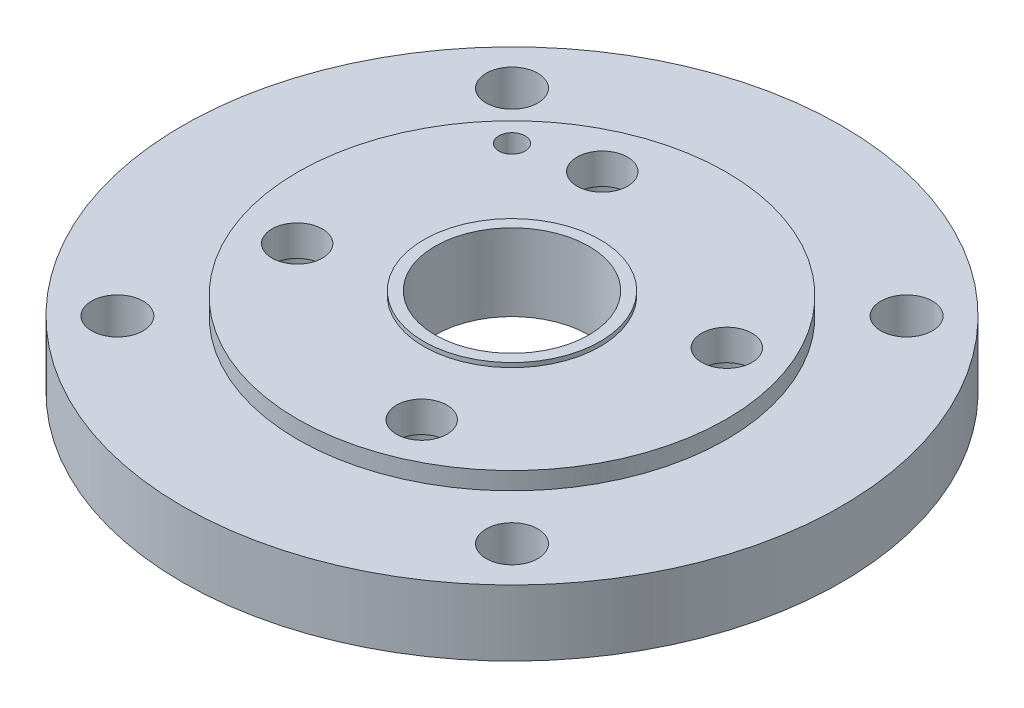
ISO-10303-21;
HEADER;
FILE_DESCRIPTION(('STEP AP214'),'2;1');
FILE_NAME('part.step','',(''),(''),'','','');
FILE_SCHEMA(('AUTOMOTIVE_DESIGN { 1 0 10303 214 1 1 1 1 }'));
ENDSEC;
DATA;
#1=APPLICATION_CONTEXT('core data for automotive mechanical design processes');
#2=APPLICATION_PROTOCOL_DEFINITION('international standard','automotive_design',2000,#1);
#3=PRODUCT_CONTEXT('',#1,'mechanical');
#4=PRODUCT('Part','Part','',(#3));
#5=PRODUCT_RELATED_PRODUCT_CATEGORY('part','',(#4));
#6=PRODUCT_DEFINITION_FORMATION('','',#4);
#7=PRODUCT_DEFINITION_CONTEXT('part definition',#1,'design');
#8=PRODUCT_DEFINITION('design','',#6,#7);
#9=PRODUCT_DEFINITION_SHAPE('','',#8);
#10=(LENGTH_UNIT() NAMED_UNIT(*) SI_UNIT(.MILLI.,.METRE.));
#11=(NAMED_UNIT(*) PLANE_ANGLE_UNIT() SI_UNIT($,.RADIAN.));
#12=(NAMED_UNIT(*) SI_UNIT($,.STERADIAN.) SOLID_ANGLE_UNIT());
#13=UNCERTAINTY_MEASURE_WITH_UNIT(LENGTH_MEASURE(1.E-05),#10,'distance_accuracy_value','');
#14=(GEOMETRIC_REPRESENTATION_CONTEXT(3) GLOBAL_UNCERTAINTY_ASSIGNED_CONTEXT((#13)) GLOBAL_UNIT_ASSIGNED_CONTEXT((#10,
#11,#12)) REPRESENTATION_CONTEXT('',''));
#15=CARTESIAN_POINT('',(0.,0.,0.));
#16=DIRECTION('',(0.,0.,1.));
#17=DIRECTION('',(1.,0.,0.));
#18=AXIS2_PLACEMENT_3D('',#15,#16,#17);
#19=CARTESIAN_POINT('',(0.,40.,0.));
#20=DIRECTION('',(0.,-1.,0.));
#21=DIRECTION('',(0.,0.,-1.));
#22=AXIS2_PLACEMENT_3D('',#19,#20,#21);
#23=CYLINDRICAL_SURFACE('',#22,35.);
#24=CARTESIAN_POINT('',(0.,40.,0.));
#25=DIRECTION('',(0.,1.,0.));
#26=DIRECTION('',(0.,0.,1.));
#27=AXIS2_PLACEMENT_3D('',#24,#25,#26);
#28=CIRCLE('',#27,35.);
#29=CARTESIAN_POINT('',(0.,40.,35.));
#30=VERTEX_POINT('',#29);
#31=EDGE_CURVE('E145',#30,#30,#28,.T.);
#32=ORIENTED_EDGE('',*,*,#31,.T.);
#33=EDGE_LOOP('',(#32));
#34=FACE_BOUND('',#33,.T.);
#35=CARTESIAN_POINT('',(0.,5.,0.));
#36=DIRECTION('',(0.,-1.,0.));
#37=DIRECTION('',(0.,0.,-1.));
#38=AXIS2_PLACEMENT_3D('',#35,#36,#37);
#39=CIRCLE('',#38,35.);
#40=CARTESIAN_POINT('',(0.,5.,-35.));
#41=VERTEX_POINT('',#40);
#42=EDGE_CURVE('E98',#41,#41,#39,.T.);
#43=ORIENTED_EDGE('',*,*,#42,.T.);
#44=EDGE_LOOP('',(#43));
#45=FACE_BOUND('',#44,.T.);
#46=ADVANCED_FACE('F65',(#34,#45),#23,.F.);
#47=CARTESIAN_POINT('',(-69.4402938607498,38.,28.3380590113846));
#48=DIRECTION('',(0.,-1.,0.));
#49=DIRECTION('',(0.,0.,-1.));
#50=AXIS2_PLACEMENT_3D('',#47,#48,#49);
#51=CYLINDRICAL_SURFACE('',#50,17.5);
#52=CARTESIAN_POINT('',(-69.4402938607498,0.,28.3380590113846));
#53=DIRECTION('',(0.,1.,0.));
#54=DIRECTION('',(0.,0.,1.));
#55=AXIS2_PLACEMENT_3D('',#52,#53,#54);
#56=CIRCLE('',#55,17.5);
#57=CARTESIAN_POINT('',(-69.4402938607498,0.,45.8380590113846));
#58=VERTEX_POINT('',#57);
#59=EDGE_CURVE('E163',#58,#58,#56,.T.);
#60=ORIENTED_EDGE('',*,*,#59,.F.);
#61=EDGE_LOOP('',(#60));
#62=FACE_BOUND('',#61,.T.);
#63=CARTESIAN_POINT('',(-69.4402938607498,24.,28.3380590113846));
#64=DIRECTION('',(0.,1.,0.));
#65=DIRECTION('',(0.,0.,1.));
#66=AXIS2_PLACEMENT_3D('',#63,#64,#65);
#67=CIRCLE('',#66,17.5);
#68=CARTESIAN_POINT('',(-69.4402938607498,24.,45.8380590113846));
#69=VERTEX_POINT('',#68);
#70=EDGE_CURVE('E113',#69,#69,#67,.T.);
#71=ORIENTED_EDGE('',*,*,#70,.T.);
#72=EDGE_LOOP('',(#71));
#73=FACE_BOUND('',#72,.T.);
#74=ADVANCED_FACE('F232',(#62,#73),#51,.F.);
#75=CARTESIAN_POINT('',(28.3380590113846,38.,69.4402938607498));
#76=DIRECTION('',(0.,-1.,0.));
#77=DIRECTION('',(0.,0.,-1.));
#78=AXIS2_PLACEMENT_3D('',#75,#76,#77);
#79=CYLINDRICAL_SURFACE('',#78,17.5);
#80=CARTESIAN_POINT('',(28.3380590113846,0.,69.4402938607498));
#81=DIRECTION('',(0.,1.,0.));
#82=DIRECTION('',(0.,0.,1.));
#83=AXIS2_PLACEMENT_3D('',#80,#81,#82);
#84=CIRCLE('',#83,17.5);
#85=CARTESIAN_POINT('',(28.3380590113846,0.,86.9402938607498));
#86=VERTEX_POINT('',#85);
#87=EDGE_CURVE('E166',#86,#86,#84,.T.);
#88=ORIENTED_EDGE('',*,*,#87,.F.);
#89=EDGE_LOOP('',(#88));
#90=FACE_BOUND('',#89,.T.);
#91=CARTESIAN_POINT('',(28.3380590113846,24.,69.4402938607498));
#92=DIRECTION('',(0.,1.,0.));
#93=DIRECTION('',(0.,0.,1.));
#94=AXIS2_PLACEMENT_3D('',#91,#92,#93);
#95=CIRCLE('',#94,17.5);
#96=CARTESIAN_POINT('',(28.3380590113846,24.,86.9402938607498));
#97=VERTEX_POINT('',#96);
#98=EDGE_CURVE('E122',#97,#97,#95,.T.);
#99=ORIENTED_EDGE('',*,*,#98,.T.);
#100=EDGE_LOOP('',(#99));
#101=FACE_BOUND('',#100,.T.);
#102=ADVANCED_FACE('F239',(#90,#101),#79,.F.);
#103=CARTESIAN_POINT('',(69.4402938607498,38.,-28.3380590113846));
#104=DIRECTION('',(0.,-1.,0.));
#105=DIRECTION('',(0.,0.,-1.));
#106=AXIS2_PLACEMENT_3D('',#103,#104,#105);
#107=CYLINDRICAL_SURFACE('',#106,17.5);
#108=CARTESIAN_POINT('',(69.4402938607498,0.,-28.3380590113846));
#109=DIRECTION('',(0.,1.,0.));
#110=DIRECTION('',(0.,0.,1.));
#111=AXIS2_PLACEMENT_3D('',#108,#109,#110);
#112=CIRCLE('',#111,17.5);
#113=CARTESIAN_POINT('',(69.4402938607498,0.,-10.8380590113846));
#114=VERTEX_POINT('',#113);
#115=EDGE_CURVE('E169',#114,#114,#112,.T.);
#116=ORIENTED_EDGE('',*,*,#115,.F.);
#117=EDGE_LOOP('',(#116));
#118=FACE_BOUND('',#117,.T.);
#119=CARTESIAN_POINT('',(69.4402938607498,24.,-28.3380590113846));
#120=DIRECTION('',(0.,1.,0.));
#121=DIRECTION('',(0.,0.,1.));
#122=AXIS2_PLACEMENT_3D('',#119,#120,#121);
#123=CIRCLE('',#122,17.5);
#124=CARTESIAN_POINT('',(69.4402938607498,24.,-10.8380590113846));
#125=VERTEX_POINT('',#124);
#126=EDGE_CURVE('E131',#125,#125,#123,.T.);
#127=ORIENTED_EDGE('',*,*,#126,.T.);
#128=EDGE_LOOP('',(#127));
#129=FACE_BOUND('',#128,.T.);
#130=ADVANCED_FACE('F331',(#118,#129),#107,.F.);
#131=CARTESIAN_POINT('',(-28.3380590113846,38.,-69.4402938607498));
#132=DIRECTION('',(0.,-1.,0.));
#133=DIRECTION('',(0.,0.,-1.));
#134=AXIS2_PLACEMENT_3D('',#131,#132,#133);
#135=CYLINDRICAL_SURFACE('',#134,17.5);
#136=CARTESIAN_POINT('',(-28.3380590113846,0.,-69.4402938607498));
#137=DIRECTION('',(0.,1.,0.));
#138=DIRECTION('',(0.,0.,1.));
#139=AXIS2_PLACEMENT_3D('',#136,#137,#138);
#140=CIRCLE('',#139,17.5);
#141=CARTESIAN_POINT('',(-28.3380590113846,0.,-51.9402938607498));
#142=VERTEX_POINT('',#141);
#143=EDGE_CURVE('E151',#142,#142,#140,.T.);
#144=ORIENTED_EDGE('',*,*,#143,.F.);
#145=EDGE_LOOP('',(#144));
#146=FACE_BOUND('',#145,.T.);
#147=CARTESIAN_POINT('',(-28.3380590113846,24.,-69.4402938607498));
#148=DIRECTION('',(0.,1.,0.));
#149=DIRECTION('',(0.,0.,1.));
#150=AXIS2_PLACEMENT_3D('',#147,#148,#149);
#151=CIRCLE('',#150,17.5);
#152=CARTESIAN_POINT('',(-28.3380590113846,24.,-51.9402938607498));
#153=VERTEX_POINT('',#152);
#154=EDGE_CURVE('E140',#153,#153,#151,.T.);
#155=ORIENTED_EDGE('',*,*,#154,.T.);
#156=EDGE_LOOP('',(#155));
#157=FACE_BOUND('',#156,.T.);
#158=ADVANCED_FACE('F199',(#146,#157),#135,.F.);
#159=CARTESIAN_POINT('',(-89.8025612106916,30.,-89.8025612106915));
#160=DIRECTION('',(0.,-1.,0.));
#161=DIRECTION('',(0.,0.,-1.));
#162=AXIS2_PLACEMENT_3D('',#159,#160,#161);
#163=CYLINDRICAL_SURFACE('',#162,11.75);
#164=CARTESIAN_POINT('',(-89.8025612106916,30.,-89.8025612106915));
#165=DIRECTION('',(0.,1.,0.));
#166=DIRECTION('',(0.,0.,1.));
#167=AXIS2_PLACEMENT_3D('',#164,#165,#166);
#168=CIRCLE('',#167,11.75);
#169=CARTESIAN_POINT('',(-89.8025612106916,30.,-78.0525612106915));
#170=VERTEX_POINT('',#169);
#171=EDGE_CURVE('E73',#170,#170,#168,.T.);
#172=ORIENTED_EDGE('',*,*,#171,.T.);
#173=EDGE_LOOP('',(#172));
#174=FACE_BOUND('',#173,.T.);
#175=CARTESIAN_POINT('',(-89.8025612106916,0.,-89.8025612106915));
#176=DIRECTION('',(0.,1.,0.));
#177=DIRECTION('',(0.,0.,1.));
#178=AXIS2_PLACEMENT_3D('',#175,#176,#177);
#179=CIRCLE('',#178,11.75);
#180=CARTESIAN_POINT('',(-89.8025612106916,0.,-78.0525612106915));
#181=VERTEX_POINT('',#180);
#182=EDGE_CURVE('E92',#181,#181,#179,.T.);
#183=ORIENTED_EDGE('',*,*,#182,.F.);
#184=EDGE_LOOP('',(#183));
#185=FACE_BOUND('',#184,.T.);
#186=ADVANCED_FACE('F196',(#174,#185),#163,.F.);
#187=CARTESIAN_POINT('',(89.8025612106915,30.,-89.8025612106916));
#188=DIRECTION('',(0.,-1.,0.));
#189=DIRECTION('',(0.,0.,-1.));
#190=AXIS2_PLACEMENT_3D('',#187,#188,#189);
#191=CYLINDRICAL_SURFACE('',#190,11.75);
#192=CARTESIAN_POINT('',(89.8025612106915,30.,-89.8025612106916));
#193=DIRECTION('',(0.,1.,0.));
#194=DIRECTION('',(0.,0.,1.));
#195=AXIS2_PLACEMENT_3D('',#192,#193,#194);
#196=CIRCLE('',#195,11.75);
#197=CARTESIAN_POINT('',(89.8025612106915,30.,-78.0525612106916));
#198=VERTEX_POINT('',#197);
#199=EDGE_CURVE('E78',#198,#198,#196,.T.);
#200=ORIENTED_EDGE('',*,*,#199,.T.);
#201=EDGE_LOOP('',(#200));
#202=FACE_BOUND('',#201,.T.);
#203=CARTESIAN_POINT('',(89.8025612106915,0.,-89.8025612106916));
#204=DIRECTION('',(0.,1.,0.));
#205=DIRECTION('',(0.,0.,1.));
#206=AXIS2_PLACEMENT_3D('',#203,#204,#205);
#207=CIRCLE('',#206,11.75);
#208=CARTESIAN_POINT('',(89.8025612106915,0.,-78.0525612106916));
#209=VERTEX_POINT('',#208);
#210=EDGE_CURVE('E89',#209,#209,#207,.T.);
#211=ORIENTED_EDGE('',*,*,#210,.F.);
#212=EDGE_LOOP('',(#211));
#213=FACE_BOUND('',#212,.T.);
#214=ADVANCED_FACE('F184',(#202,#213),#191,.F.);
#215=CARTESIAN_POINT('',(89.8025612106916,30.,89.8025612106915));
#216=DIRECTION('',(0.,-1.,0.));
#217=DIRECTION('',(0.,0.,-1.));
#218=AXIS2_PLACEMENT_3D('',#215,#216,#217);
#219=CYLINDRICAL_SURFACE('',#218,11.75);
#220=CARTESIAN_POINT('',(89.8025612106916,30.,89.8025612106915));
#221=DIRECTION('',(0.,1.,0.));
#222=DIRECTION('',(0.,0.,1.));
#223=AXIS2_PLACEMENT_3D('',#220,#221,#222);
#224=CIRCLE('',#223,11.75);
#225=CARTESIAN_POINT('',(89.8025612106916,30.,101.552561210692));
#226=VERTEX_POINT('',#225);
#227=EDGE_CURVE('E179',#226,#226,#224,.T.);
#228=ORIENTED_EDGE('',*,*,#227,.T.);
#229=EDGE_LOOP('',(#228));
#230=FACE_BOUND('',#229,.T.);
#231=CARTESIAN_POINT('',(89.8025612106916,0.,89.8025612106915));
#232=DIRECTION('',(0.,1.,0.));
#233=DIRECTION('',(0.,0.,1.));
#234=AXIS2_PLACEMENT_3D('',#231,#232,#233);
#235=CIRCLE('',#234,11.75);
#236=CARTESIAN_POINT('',(89.8025612106916,0.,101.552561210692));
#237=VERTEX_POINT('',#236);
#238=EDGE_CURVE('E85',#237,#237,#235,.T.);
#239=ORIENTED_EDGE('',*,*,#238,.F.);
#240=EDGE_LOOP('',(#239));
#241=FACE_BOUND('',#240,.T.);
#242=ADVANCED_FACE('F393',(#230,#241),#219,.F.);
#243=CARTESIAN_POINT('',(-89.8025612106915,30.,89.8025612106916));
#244=DIRECTION('',(0.,-1.,0.));
#245=DIRECTION('',(0.,0.,-1.));
#246=AXIS2_PLACEMENT_3D('',#243,#244,#245);
#247=CYLINDRICAL_SURFACE('',#246,11.75);
#248=CARTESIAN_POINT('',(-89.8025612106915,30.,89.8025612106916));
#249=DIRECTION('',(0.,1.,0.));
#250=DIRECTION('',(0.,0.,1.));
#251=AXIS2_PLACEMENT_3D('',#248,#249,#250);
#252=CIRCLE('',#251,11.75);
#253=CARTESIAN_POINT('',(-89.8025612106915,30.,101.552561210692));
#254=VERTEX_POINT('',#253);
#255=EDGE_CURVE('E176',#254,#254,#252,.T.);
#256=ORIENTED_EDGE('',*,*,#255,.T.);
#257=EDGE_LOOP('',(#256));
#258=FACE_BOUND('',#257,.T.);
#259=CARTESIAN_POINT('',(-89.8025612106915,0.,89.8025612106916));
#260=DIRECTION('',(0.,1.,0.));
#261=DIRECTION('',(0.,0.,1.));
#262=AXIS2_PLACEMENT_3D('',#259,#260,#261);
#263=CIRCLE('',#262,11.75);
#264=CARTESIAN_POINT('',(-89.8025612106915,0.,101.552561210692));
#265=VERTEX_POINT('',#264);
#266=EDGE_CURVE('E82',#265,#265,#263,.T.);
#267=ORIENTED_EDGE('',*,*,#266,.F.);
#268=EDGE_LOOP('',(#267));
#269=FACE_BOUND('',#268,.T.);
#270=ADVANCED_FACE('F67',(#258,#269),#247,.F.);
#271=CARTESIAN_POINT('',(0.,30.,0.));
#272=DIRECTION('',(0.,-1.,0.));
#273=DIRECTION('',(0.,0.,-1.));
#274=AXIS2_PLACEMENT_3D('',#271,#272,#273);
#275=CYLINDRICAL_SURFACE('',#274,150.);
#276=CARTESIAN_POINT('',(0.,30.,0.));
#277=DIRECTION('',(0.,1.,0.));
#278=DIRECTION('',(0.,0.,1.));
#279=AXIS2_PLACEMENT_3D('',#276,#277,#278);
#280=CIRCLE('',#279,150.);
#281=CARTESIAN_POINT('',(0.,30.,150.));
#282=VERTEX_POINT('',#281);
#283=EDGE_CURVE('E11',#282,#282,#280,.T.);
#284=ORIENTED_EDGE('',*,*,#283,.F.);
#285=EDGE_LOOP('',(#284));
#286=FACE_BOUND('',#285,.T.);
#287=CARTESIAN_POINT('',(0.,0.,0.));
#288=DIRECTION('',(0.,1.,0.));
#289=DIRECTION('',(0.,0.,1.));
#290=AXIS2_PLACEMENT_3D('',#287,#288,#289);
#291=CIRCLE('',#290,150.);
#292=CARTESIAN_POINT('',(0.,0.,150.));
#293=VERTEX_POINT('',#292);
#294=EDGE_CURVE('E95',#293,#293,#291,.T.);
#295=ORIENTED_EDGE('',*,*,#294,.T.);
#296=EDGE_LOOP('',(#295));
#297=FACE_BOUND('',#296,.T.);
#298=ADVANCED_FACE('F191',(#286,#297),#275,.T.);
#299=CARTESIAN_POINT('',(0.,30.,0.));
#300=DIRECTION('',(0.,1.,0.));
#301=DIRECTION('',(0.,0.,1.));
#302=AXIS2_PLACEMENT_3D('',#299,#300,#301);
#303=PLANE('',#302);
#304=CARTESIAN_POINT('',(0.,30.,0.));
#305=DIRECTION('',(0.,1.,0.));
#306=DIRECTION('',(0.,0.,1.));
#307=AXIS2_PLACEMENT_3D('',#304,#305,#306);
#308=CIRCLE('',#307,97.5);
#309=CARTESIAN_POINT('',(0.,30.,97.5));
#310=VERTEX_POINT('',#309);
#311=EDGE_CURVE('E97',#310,#310,#308,.T.);
#312=ORIENTED_EDGE('',*,*,#311,.F.);
#313=EDGE_LOOP('',(#312));
#314=FACE_BOUND('',#313,.T.);
#315=ORIENTED_EDGE('',*,*,#255,.F.);
#316=EDGE_LOOP('',(#315));
#317=FACE_BOUND('',#316,.T.);
#318=ORIENTED_EDGE('',*,*,#227,.F.);
#319=EDGE_LOOP('',(#318));
#320=FACE_BOUND('',#319,.T.);
#321=ORIENTED_EDGE('',*,*,#199,.F.);
#322=EDGE_LOOP('',(#321));
#323=FACE_BOUND('',#322,.T.);
#324=ORIENTED_EDGE('',*,*,#171,.F.);
#325=EDGE_LOOP('',(#324));
#326=FACE_BOUND('',#325,.T.);
#327=ORIENTED_EDGE('',*,*,#283,.T.);
#328=EDGE_LOOP('',(#327));
#329=FACE_BOUND('',#328,.T.);
#330=ADVANCED_FACE('F187',(#314,#317,#320,#323,#326,#329),#303,.T.);
#331=CARTESIAN_POINT('',(0.,0.,0.));
#332=DIRECTION('',(0.,1.,0.));
#333=DIRECTION('',(0.,0.,1.));
#334=AXIS2_PLACEMENT_3D('',#331,#332,#333);
#335=PLANE('',#334);
#336=CARTESIAN_POINT('',(0.,0.,0.));
#337=DIRECTION('',(0.,1.,0.));
#338=DIRECTION('',(0.,0.,1.));
#339=AXIS2_PLACEMENT_3D('',#336,#337,#338);
#340=CIRCLE('',#339,43.5);
#341=CARTESIAN_POINT('',(0.,0.,43.5));
#342=VERTEX_POINT('',#341);
#343=EDGE_CURVE('E69',#342,#342,#340,.F.);
#344=ORIENTED_EDGE('',*,*,#343,.F.);
#345=EDGE_LOOP('',(#344));
#346=FACE_BOUND('',#345,.T.);
#347=ORIENTED_EDGE('',*,*,#266,.T.);
#348=EDGE_LOOP('',(#347));
#349=FACE_BOUND('',#348,.T.);
#350=ORIENTED_EDGE('',*,*,#238,.T.);
#351=EDGE_LOOP('',(#350));
#352=FACE_BOUND('',#351,.T.);
#353=ORIENTED_EDGE('',*,*,#210,.T.);
#354=EDGE_LOOP('',(#353));
#355=FACE_BOUND('',#354,.T.);
#356=ORIENTED_EDGE('',*,*,#182,.T.);
#357=EDGE_LOOP('',(#356));
#358=FACE_BOUND('',#357,.T.);
#359=ORIENTED_EDGE('',*,*,#294,.F.);
#360=EDGE_LOOP('',(#359));
#361=FACE_BOUND('',#360,.T.);
#362=ORIENTED_EDGE('',*,*,#143,.T.);
#363=EDGE_LOOP('',(#362));
#364=FACE_BOUND('',#363,.T.);
#365=ORIENTED_EDGE('',*,*,#59,.T.);
#366=EDGE_LOOP('',(#365));
#367=FACE_BOUND('',#366,.T.);
#368=ORIENTED_EDGE('',*,*,#87,.T.);
#369=EDGE_LOOP('',(#368));
#370=FACE_BOUND('',#369,.T.);
#371=ORIENTED_EDGE('',*,*,#115,.T.);
#372=EDGE_LOOP('',(#371));
#373=FACE_BOUND('',#372,.T.);
#374=CARTESIAN_POINT('',(-60.,0.,-60.));
#375=DIRECTION('',(0.,1.,0.));
#376=DIRECTION('',(0.,0.,1.));
#377=AXIS2_PLACEMENT_3D('',#374,#375,#376);
#378=CIRCLE('',#377,6.00000000000001);
#379=CARTESIAN_POINT('',(-60.,0.,-54.));
#380=VERTEX_POINT('',#379);
#381=EDGE_CURVE('E156',#380,#380,#378,.T.);
#382=ORIENTED_EDGE('',*,*,#381,.T.);
#383=EDGE_LOOP('',(#382));
#384=FACE_BOUND('',#383,.T.);
#385=ADVANCED_FACE('F190',(#346,#349,#352,#355,#358,#361,#364,#367,#370,#373,#384),#335,.F.);
#386=CARTESIAN_POINT('',(-60.,38.,-60.));
#387=DIRECTION('',(0.,-1.,0.));
#388=DIRECTION('',(0.,0.,-1.));
#389=AXIS2_PLACEMENT_3D('',#386,#387,#388);
#390=CYLINDRICAL_SURFACE('',#389,6.00000000000001);
#391=CARTESIAN_POINT('',(-60.,38.,-60.));
#392=DIRECTION('',(0.,1.,0.));
#393=DIRECTION('',(0.,0.,1.));
#394=AXIS2_PLACEMENT_3D('',#391,#392,#393);
#395=CIRCLE('',#394,6.00000000000001);
#396=CARTESIAN_POINT('',(-60.,38.,-54.));
#397=VERTEX_POINT('',#396);
#398=EDGE_CURVE('E155',#397,#397,#395,.T.);
#399=ORIENTED_EDGE('',*,*,#398,.T.);
#400=EDGE_LOOP('',(#399));
#401=FACE_BOUND('',#400,.T.);
#402=ORIENTED_EDGE('',*,*,#381,.F.);
#403=EDGE_LOOP('',(#402));
#404=FACE_BOUND('',#403,.T.);
#405=ADVANCED_FACE('F205',(#401,#404),#390,.F.);
#406=CARTESIAN_POINT('',(0.,38.,0.));
#407=DIRECTION('',(0.,-1.,0.));
#408=DIRECTION('',(0.,0.,-1.));
#409=AXIS2_PLACEMENT_3D('',#406,#407,#408);
#410=CYLINDRICAL_SURFACE('',#409,97.5);
#411=ORIENTED_EDGE('',*,*,#311,.T.);
#412=EDGE_LOOP('',(#411));
#413=FACE_BOUND('',#412,.T.);
#414=CARTESIAN_POINT('',(0.,38.,0.));
#415=DIRECTION('',(0.,1.,0.));
#416=DIRECTION('',(0.,0.,1.));
#417=AXIS2_PLACEMENT_3D('',#414,#415,#416);
#418=CIRCLE('',#417,97.5);
#419=CARTESIAN_POINT('',(0.,38.,97.5));
#420=VERTEX_POINT('',#419);
#421=EDGE_CURVE('E86',#420,#420,#418,.T.);
#422=ORIENTED_EDGE('',*,*,#421,.F.);
#423=EDGE_LOOP('',(#422));
#424=FACE_BOUND('',#423,.T.);
#425=ADVANCED_FACE('F221',(#413,#424),#410,.T.);
#426=CARTESIAN_POINT('',(0.,38.,0.));
#427=DIRECTION('',(0.,1.,0.));
#428=DIRECTION('',(0.,0.,1.));
#429=AXIS2_PLACEMENT_3D('',#426,#427,#428);
#430=PLANE('',#429);
#431=CARTESIAN_POINT('',(0.,38.,0.));
#432=DIRECTION('',(0.,1.,0.));
#433=DIRECTION('',(0.,0.,1.));
#434=AXIS2_PLACEMENT_3D('',#431,#432,#433);
#435=CIRCLE('',#434,40.15);
#436=CARTESIAN_POINT('',(0.,38.,40.15));
#437=VERTEX_POINT('',#436);
#438=EDGE_CURVE('E152',#437,#437,#435,.T.);
#439=ORIENTED_EDGE('',*,*,#438,.F.);
#440=EDGE_LOOP('',(#439));
#441=FACE_BOUND('',#440,.T.);
#442=ORIENTED_EDGE('',*,*,#398,.F.);
#443=EDGE_LOOP('',(#442));
#444=FACE_BOUND('',#443,.T.);
#445=ORIENTED_EDGE('',*,*,#421,.T.);
#446=EDGE_LOOP('',(#445));
#447=FACE_BOUND('',#446,.T.);
#448=CARTESIAN_POINT('',(-28.3380590113846,38.,-69.4402938607498));
#449=DIRECTION('',(0.,1.,0.));
#450=DIRECTION('',(0.,0.,1.));
#451=AXIS2_PLACEMENT_3D('',#448,#449,#450);
#452=CIRCLE('',#451,11.5);
#453=CARTESIAN_POINT('',(-28.3380590113846,38.,-57.9402938607498));
#454=VERTEX_POINT('',#453);
#455=EDGE_CURVE('E136',#454,#454,#452,.T.);
#456=ORIENTED_EDGE('',*,*,#455,.F.);
#457=EDGE_LOOP('',(#456));
#458=FACE_BOUND('',#457,.T.);
#459=CARTESIAN_POINT('',(69.4402938607498,38.,-28.3380590113846));
#460=DIRECTION('',(0.,1.,0.));
#461=DIRECTION('',(0.,0.,1.));
#462=AXIS2_PLACEMENT_3D('',#459,#460,#461);
#463=CIRCLE('',#462,11.5);
#464=CARTESIAN_POINT('',(69.4402938607498,38.,-16.8380590113846));
#465=VERTEX_POINT('',#464);
#466=EDGE_CURVE('E127',#465,#465,#463,.T.);
#467=ORIENTED_EDGE('',*,*,#466,.F.);
#468=EDGE_LOOP('',(#467));
#469=FACE_BOUND('',#468,.T.);
#470=CARTESIAN_POINT('',(28.3380590113846,38.,69.4402938607498));
#471=DIRECTION('',(0.,1.,0.));
#472=DIRECTION('',(0.,0.,1.));
#473=AXIS2_PLACEMENT_3D('',#470,#471,#472);
#474=CIRCLE('',#473,11.5);
#475=CARTESIAN_POINT('',(28.3380590113846,38.,80.9402938607498));
#476=VERTEX_POINT('',#475);
#477=EDGE_CURVE('E118',#476,#476,#474,.T.);
#478=ORIENTED_EDGE('',*,*,#477,.F.);
#479=EDGE_LOOP('',(#478));
#480=FACE_BOUND('',#479,.T.);
#481=CARTESIAN_POINT('',(-69.4402938607498,38.,28.3380590113846));
#482=DIRECTION('',(0.,1.,0.));
#483=DIRECTION('',(0.,0.,1.));
#484=AXIS2_PLACEMENT_3D('',#481,#482,#483);
#485=CIRCLE('',#484,11.5);
#486=CARTESIAN_POINT('',(-69.4402938607498,38.,39.8380590113846));
#487=VERTEX_POINT('',#486);
#488=EDGE_CURVE('E104',#487,#487,#485,.T.);
#489=ORIENTED_EDGE('',*,*,#488,.F.);
#490=EDGE_LOOP('',(#489));
#491=FACE_BOUND('',#490,.T.);
#492=ADVANCED_FACE('F227',(#441,#444,#447,#458,#469,#480,#491),#430,.T.);
#493=CARTESIAN_POINT('',(0.,40.,0.));
#494=DIRECTION('',(0.,-1.,0.));
#495=DIRECTION('',(0.,0.,-1.));
#496=AXIS2_PLACEMENT_3D('',#493,#494,#495);
#497=CYLINDRICAL_SURFACE('',#496,40.15);
#498=ORIENTED_EDGE('',*,*,#438,.T.);
#499=EDGE_LOOP('',(#498));
#500=FACE_BOUND('',#499,.T.);
#501=CARTESIAN_POINT('',(0.,40.,0.));
#502=DIRECTION('',(0.,1.,0.));
#503=DIRECTION('',(0.,0.,1.));
#504=AXIS2_PLACEMENT_3D('',#501,#502,#503);
#505=CIRCLE('',#504,40.15);
#506=CARTESIAN_POINT('',(0.,40.,40.15));
#507=VERTEX_POINT('',#506);
#508=EDGE_CURVE('E148',#507,#507,#505,.T.);
#509=ORIENTED_EDGE('',*,*,#508,.F.);
#510=EDGE_LOOP('',(#509));
#511=FACE_BOUND('',#510,.T.);
#512=ADVANCED_FACE('F244',(#500,#511),#497,.T.);
#513=CARTESIAN_POINT('',(0.,40.,0.));
#514=DIRECTION('',(0.,1.,0.));
#515=DIRECTION('',(0.,0.,1.));
#516=AXIS2_PLACEMENT_3D('',#513,#514,#515);
#517=PLANE('',#516);
#518=ORIENTED_EDGE('',*,*,#31,.F.);
#519=EDGE_LOOP('',(#518));
#520=FACE_BOUND('',#519,.T.);
#521=ORIENTED_EDGE('',*,*,#508,.T.);
#522=EDGE_LOOP('',(#521));
#523=FACE_BOUND('',#522,.T.);
#524=ADVANCED_FACE('F253',(#520,#523),#517,.T.);
#525=CARTESIAN_POINT('',(-28.3380590113846,24.,-69.4402938607498));
#526=DIRECTION('',(0.,1.,0.));
#527=DIRECTION('',(0.,0.,1.));
#528=AXIS2_PLACEMENT_3D('',#525,#526,#527);
#529=PLANE('',#528);
#530=CARTESIAN_POINT('',(-28.3380590113846,24.,-69.4402938607498));
#531=DIRECTION('',(0.,1.,0.));
#532=DIRECTION('',(0.,0.,1.));
#533=AXIS2_PLACEMENT_3D('',#530,#531,#532);
#534=CIRCLE('',#533,11.5);
#535=CARTESIAN_POINT('',(-28.3380590113846,24.,-57.9402938607498));
#536=VERTEX_POINT('',#535);
#537=EDGE_CURVE('E137',#536,#536,#534,.T.);
#538=ORIENTED_EDGE('',*,*,#537,.T.);
#539=EDGE_LOOP('',(#538));
#540=FACE_BOUND('',#539,.T.);
#541=ORIENTED_EDGE('',*,*,#154,.F.);
#542=EDGE_LOOP('',(#541));
#543=FACE_BOUND('',#542,.T.);
#544=ADVANCED_FACE('F305',(#540,#543),#529,.F.);
#545=CARTESIAN_POINT('',(-28.3380590113846,24.,-69.4402938607498));
#546=DIRECTION('',(0.,1.,0.));
#547=DIRECTION('',(0.,0.,1.));
#548=AXIS2_PLACEMENT_3D('',#545,#546,#547);
#549=CYLINDRICAL_SURFACE('',#548,11.5);
#550=ORIENTED_EDGE('',*,*,#537,.F.);
#551=EDGE_LOOP('',(#550));
#552=FACE_BOUND('',#551,.T.);
#553=ORIENTED_EDGE('',*,*,#455,.T.);
#554=EDGE_LOOP('',(#553));
#555=FACE_BOUND('',#554,.T.);
#556=ADVANCED_FACE('F301',(#552,#555),#549,.F.);
#557=CARTESIAN_POINT('',(69.4402938607498,24.,-28.3380590113846));
#558=DIRECTION('',(0.,1.,0.));
#559=DIRECTION('',(0.,0.,1.));
#560=AXIS2_PLACEMENT_3D('',#557,#558,#559);
#561=PLANE('',#560);
#562=CARTESIAN_POINT('',(69.4402938607498,24.,-28.3380590113846));
#563=DIRECTION('',(0.,1.,0.));
#564=DIRECTION('',(0.,0.,1.));
#565=AXIS2_PLACEMENT_3D('',#562,#563,#564);
#566=CIRCLE('',#565,11.5);
#567=CARTESIAN_POINT('',(69.4402938607498,24.,-16.8380590113846));
#568=VERTEX_POINT('',#567);
#569=EDGE_CURVE('E128',#568,#568,#566,.T.);
#570=ORIENTED_EDGE('',*,*,#569,.T.);
#571=EDGE_LOOP('',(#570));
#572=FACE_BOUND('',#571,.T.);
#573=ORIENTED_EDGE('',*,*,#126,.F.);
#574=EDGE_LOOP('',(#573));
#575=FACE_BOUND('',#574,.T.);
#576=ADVANCED_FACE('F297',(#572,#575),#561,.F.);
#577=CARTESIAN_POINT('',(69.4402938607498,24.,-28.3380590113846));
#578=DIRECTION('',(0.,1.,0.));
#579=DIRECTION('',(0.,0.,1.));
#580=AXIS2_PLACEMENT_3D('',#577,#578,#579);
#581=CYLINDRICAL_SURFACE('',#580,11.5);
#582=ORIENTED_EDGE('',*,*,#569,.F.);
#583=EDGE_LOOP('',(#582));
#584=FACE_BOUND('',#583,.T.);
#585=ORIENTED_EDGE('',*,*,#466,.T.);
#586=EDGE_LOOP('',(#585));
#587=FACE_BOUND('',#586,.T.);
#588=ADVANCED_FACE('F293',(#584,#587),#581,.F.);
#589=CARTESIAN_POINT('',(28.3380590113846,24.,69.4402938607498));
#590=DIRECTION('',(0.,1.,0.));
#591=DIRECTION('',(0.,0.,1.));
#592=AXIS2_PLACEMENT_3D('',#589,#590,#591);
#593=PLANE('',#592);
#594=CARTESIAN_POINT('',(28.3380590113846,24.,69.4402938607498));
#595=DIRECTION('',(0.,1.,0.));
#596=DIRECTION('',(0.,0.,1.));
#597=AXIS2_PLACEMENT_3D('',#594,#595,#596);
#598=CIRCLE('',#597,11.5);
#599=CARTESIAN_POINT('',(28.3380590113846,24.,80.9402938607498));
#600=VERTEX_POINT('',#599);
#601=EDGE_CURVE('E119',#600,#600,#598,.T.);
#602=ORIENTED_EDGE('',*,*,#601,.T.);
#603=EDGE_LOOP('',(#602));
#604=FACE_BOUND('',#603,.T.);
#605=ORIENTED_EDGE('',*,*,#98,.F.);
#606=EDGE_LOOP('',(#605));
#607=FACE_BOUND('',#606,.T.);
#608=ADVANCED_FACE('F289',(#604,#607),#593,.F.);
#609=CARTESIAN_POINT('',(28.3380590113846,24.,69.4402938607498));
#610=DIRECTION('',(0.,1.,0.));
#611=DIRECTION('',(0.,0.,1.));
#612=AXIS2_PLACEMENT_3D('',#609,#610,#611);
#613=CYLINDRICAL_SURFACE('',#612,11.5);
#614=ORIENTED_EDGE('',*,*,#601,.F.);
#615=EDGE_LOOP('',(#614));
#616=FACE_BOUND('',#615,.T.);
#617=ORIENTED_EDGE('',*,*,#477,.T.);
#618=EDGE_LOOP('',(#617));
#619=FACE_BOUND('',#618,.T.);
#620=ADVANCED_FACE('F281',(#616,#619),#613,.F.);
#621=CARTESIAN_POINT('',(-69.4402938607498,24.,28.3380590113846));
#622=DIRECTION('',(0.,1.,0.));
#623=DIRECTION('',(0.,0.,1.));
#624=AXIS2_PLACEMENT_3D('',#621,#622,#623);
#625=PLANE('',#624);
#626=CARTESIAN_POINT('',(-69.4402938607498,24.,28.3380590113846));
#627=DIRECTION('',(0.,1.,0.));
#628=DIRECTION('',(0.,0.,1.));
#629=AXIS2_PLACEMENT_3D('',#626,#627,#628);
#630=CIRCLE('',#629,11.5);
#631=CARTESIAN_POINT('',(-69.4402938607498,24.,39.8380590113846));
#632=VERTEX_POINT('',#631);
#633=EDGE_CURVE('E110',#632,#632,#630,.T.);
#634=ORIENTED_EDGE('',*,*,#633,.T.);
#635=EDGE_LOOP('',(#634));
#636=FACE_BOUND('',#635,.T.);
#637=ORIENTED_EDGE('',*,*,#70,.F.);
#638=EDGE_LOOP('',(#637));
#639=FACE_BOUND('',#638,.T.);
#640=ADVANCED_FACE('F271',(#636,#639),#625,.F.);
#641=CARTESIAN_POINT('',(-69.4402938607498,24.,28.3380590113846));
#642=DIRECTION('',(0.,1.,0.));
#643=DIRECTION('',(0.,0.,1.));
#644=AXIS2_PLACEMENT_3D('',#641,#642,#643);
#645=CYLINDRICAL_SURFACE('',#644,11.5);
#646=ORIENTED_EDGE('',*,*,#633,.F.);
#647=EDGE_LOOP('',(#646));
#648=FACE_BOUND('',#647,.T.);
#649=ORIENTED_EDGE('',*,*,#488,.T.);
#650=EDGE_LOOP('',(#649));
#651=FACE_BOUND('',#650,.T.);
#652=ADVANCED_FACE('F269',(#648,#651),#645,.F.);
#653=CARTESIAN_POINT('',(0.,-1.2E-05,0.));
#654=DIRECTION('',(0.,1.,0.));
#655=DIRECTION('',(0.,0.,1.));
#656=AXIS2_PLACEMENT_3D('',#653,#654,#655);
#657=CYLINDRICAL_SURFACE('',#656,43.5);
#658=CARTESIAN_POINT('',(0.,5.,0.));
#659=DIRECTION('',(0.,-1.,0.));
#660=DIRECTION('',(0.,0.,-1.));
#661=AXIS2_PLACEMENT_3D('',#658,#659,#660);
#662=CIRCLE('',#661,43.5);
#663=CARTESIAN_POINT('',(0.,5.,-43.5));
#664=VERTEX_POINT('',#663);
#665=EDGE_CURVE('E100',#664,#664,#662,.T.);
#666=ORIENTED_EDGE('',*,*,#665,.F.);
#667=EDGE_LOOP('',(#666));
#668=FACE_BOUND('',#667,.T.);
#669=ORIENTED_EDGE('',*,*,#343,.T.);
#670=EDGE_LOOP('',(#669));
#671=FACE_BOUND('',#670,.T.);
#672=ADVANCED_FACE('F270',(#668,#671),#657,.F.);
#673=CARTESIAN_POINT('',(0.,5.,0.));
#674=DIRECTION('',(0.,-1.,0.));
#675=DIRECTION('',(0.,0.,-1.));
#676=AXIS2_PLACEMENT_3D('',#673,#674,#675);
#677=PLANE('',#676);
#678=ORIENTED_EDGE('',*,*,#42,.F.);
#679=EDGE_LOOP('',(#678));
#680=FACE_BOUND('',#679,.T.);
#681=ORIENTED_EDGE('',*,*,#665,.T.);
#682=EDGE_LOOP('',(#681));
#683=FACE_BOUND('',#682,.T.);
#684=ADVANCED_FACE('F278',(#680,#683),#677,.T.);
#685=CLOSED_SHELL('',(#46,#74,#102,#130,#158,#186,#214,#242,#270,#298,#330,#385,#405,#425,#492,
#512,#524,#544,#556,#576,#588,#608,#620,#640,#652,#672,#684));
#686=MANIFOLD_SOLID_BREP('B2',#685);
#687=ADVANCED_BREP_SHAPE_REPRESENTATION('',(#18,#686),#14);
#688=SHAPE_DEFINITION_REPRESENTATION(#9,#687);
ENDSEC;
END-ISO-10303-21;
